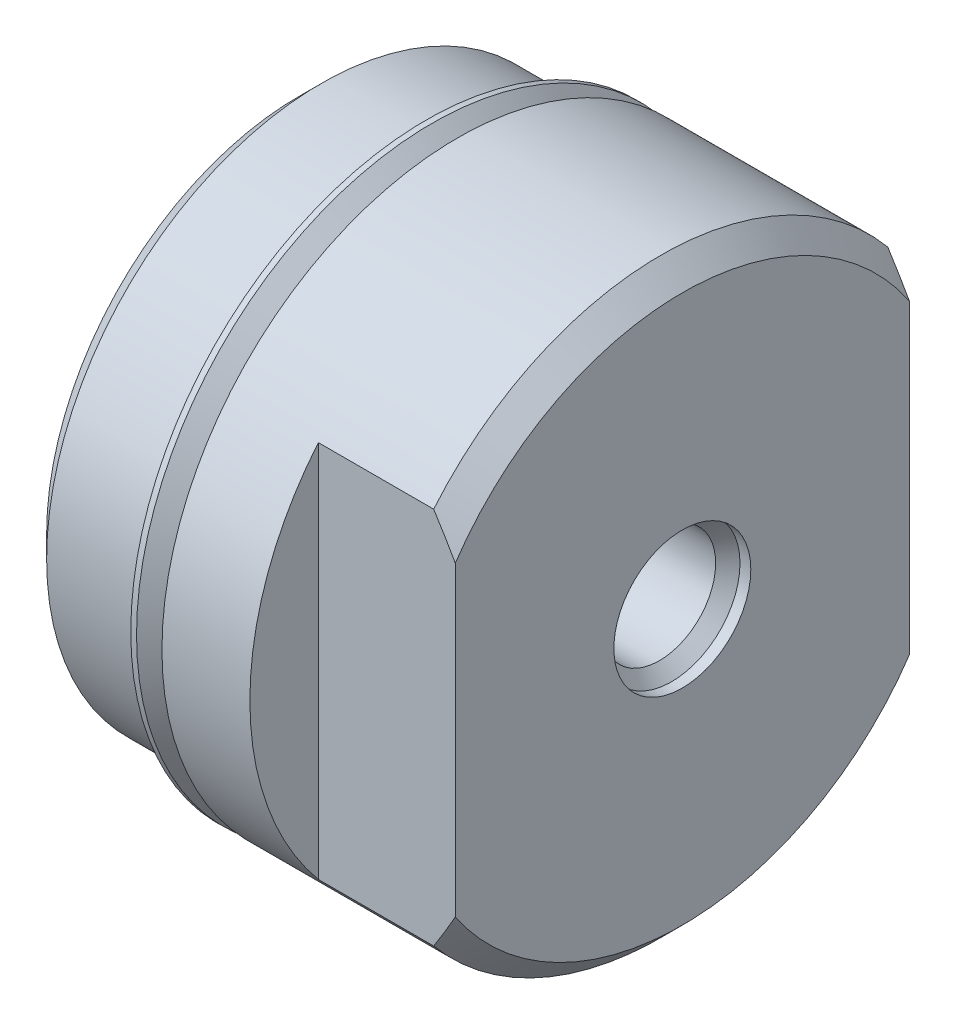
ISO-10303-21;
HEADER;
FILE_DESCRIPTION(('STEP AP214'),'2;1');
FILE_NAME('part.step','',(''),(''),'','','');
FILE_SCHEMA(('AUTOMOTIVE_DESIGN { 1 0 10303 214 1 1 1 1 }'));
ENDSEC;
DATA;
#1=APPLICATION_CONTEXT('core data for automotive mechanical design processes');
#2=APPLICATION_PROTOCOL_DEFINITION('international standard','automotive_design',2000,#1);
#3=PRODUCT_CONTEXT('',#1,'mechanical');
#4=PRODUCT('Part','Part','',(#3));
#5=PRODUCT_RELATED_PRODUCT_CATEGORY('part','',(#4));
#6=PRODUCT_DEFINITION_FORMATION('','',#4);
#7=PRODUCT_DEFINITION_CONTEXT('part definition',#1,'design');
#8=PRODUCT_DEFINITION('design','',#6,#7);
#9=PRODUCT_DEFINITION_SHAPE('','',#8);
#10=(LENGTH_UNIT() NAMED_UNIT(*) SI_UNIT(.MILLI.,.METRE.));
#11=(NAMED_UNIT(*) PLANE_ANGLE_UNIT() SI_UNIT($,.RADIAN.));
#12=(NAMED_UNIT(*) SI_UNIT($,.STERADIAN.) SOLID_ANGLE_UNIT());
#13=UNCERTAINTY_MEASURE_WITH_UNIT(LENGTH_MEASURE(1.E-05),#10,'distance_accuracy_value','');
#14=(GEOMETRIC_REPRESENTATION_CONTEXT(3) GLOBAL_UNCERTAINTY_ASSIGNED_CONTEXT((#13)) GLOBAL_UNIT_ASSIGNED_CONTEXT((#10,
#11,#12)) REPRESENTATION_CONTEXT('',''));
#15=CARTESIAN_POINT('',(0.,0.,0.));
#16=DIRECTION('',(0.,0.,1.));
#17=DIRECTION('',(1.,0.,0.));
#18=AXIS2_PLACEMENT_3D('',#15,#16,#17);
#19=CARTESIAN_POINT('',(5.5626,8.9154,0.));
#20=DIRECTION('',(1.,0.,0.));
#21=DIRECTION('',(0.,0.,-1.));
#22=AXIS2_PLACEMENT_3D('',#19,#20,#21);
#23=PLANE('',#22);
#24=CARTESIAN_POINT('',(5.5626,0.,0.));
#25=DIRECTION('',(-1.,0.,0.));
#26=DIRECTION('',(0.,0.,1.));
#27=AXIS2_PLACEMENT_3D('',#24,#25,#26);
#28=CIRCLE('',#27,8.9154);
#29=CARTESIAN_POINT('',(5.5626,0.,8.9154));
#30=VERTEX_POINT('',#29);
#31=EDGE_CURVE('E121',#30,#30,#28,.T.);
#32=ORIENTED_EDGE('',*,*,#31,.F.);
#33=EDGE_LOOP('',(#32));
#34=FACE_BOUND('',#33,.T.);
#35=CARTESIAN_POINT('',(5.5626,0.,0.));
#36=DIRECTION('',(1.,0.,0.));
#37=DIRECTION('',(0.,0.,-1.));
#38=AXIS2_PLACEMENT_3D('',#35,#36,#37);
#39=CIRCLE('',#38,9.2310307345285);
#40=CARTESIAN_POINT('',(5.5626,0.,-9.2310307345285));
#41=VERTEX_POINT('',#40);
#42=EDGE_CURVE('E11',#41,#41,#39,.T.);
#43=ORIENTED_EDGE('',*,*,#42,.F.);
#44=EDGE_LOOP('',(#43));
#45=FACE_BOUND('',#44,.T.);
#46=ADVANCED_FACE('F36',(#34,#45),#23,.F.);
#47=CARTESIAN_POINT('',(5.5626,0.,0.));
#48=DIRECTION('',(-1.,0.,0.));
#49=DIRECTION('',(0.,0.,1.));
#50=AXIS2_PLACEMENT_3D('',#47,#48,#49);
#51=CIRCLE('',#50,10.414);
#52=CARTESIAN_POINT('',(5.5626,0.,10.414));
#53=VERTEX_POINT('',#52);
#54=EDGE_CURVE('E118',#53,#53,#51,.T.);
#55=ORIENTED_EDGE('',*,*,#54,.T.);
#56=EDGE_LOOP('',(#55));
#57=FACE_BOUND('',#56,.T.);
#58=CARTESIAN_POINT('',(5.5626,0.,0.));
#59=DIRECTION('',(1.,0.,0.));
#60=DIRECTION('',(0.,0.,-1.));
#61=AXIS2_PLACEMENT_3D('',#58,#59,#60);
#62=CIRCLE('',#61,9.5183989304027);
#63=CARTESIAN_POINT('',(5.5626,0.,-9.5183989304027));
#64=VERTEX_POINT('',#63);
#65=EDGE_CURVE('E44',#64,#64,#62,.F.);
#66=ORIENTED_EDGE('',*,*,#65,.F.);
#67=EDGE_LOOP('',(#66));
#68=FACE_BOUND('',#67,.T.);
#69=ADVANCED_FACE('F202',(#57,#68),#23,.F.);
#70=CARTESIAN_POINT('',(13.4874,0.,0.));
#71=DIRECTION('',(-1.,0.,0.));
#72=DIRECTION('',(0.,0.,1.));
#73=AXIS2_PLACEMENT_3D('',#70,#71,#72);
#74=CYLINDRICAL_SURFACE('',#73,10.414);
#75=ORIENTED_EDGE('',*,*,#54,.F.);
#76=EDGE_LOOP('',(#75));
#77=FACE_BOUND('',#76,.T.);
#78=DIRECTION('',(-1.,0.,0.));
#79=VECTOR('',#78,1.);
#80=CARTESIAN_POINT('',(13.4874,6.66598792378144,8.001));
#81=LINE('',#80,#79);
#82=CARTESIAN_POINT('',(12.7254,6.66598792378144,8.001));
#83=VERTEX_POINT('',#82);
#84=CARTESIAN_POINT('',(8.6614,6.66598792378144,8.001));
#85=VERTEX_POINT('',#84);
#86=EDGE_CURVE('E156',#83,#85,#81,.T.);
#87=ORIENTED_EDGE('',*,*,#86,.F.);
#88=CARTESIAN_POINT('',(12.7254,0.,0.));
#89=DIRECTION('',(-1.,0.,0.));
#90=DIRECTION('',(0.,0.,1.));
#91=AXIS2_PLACEMENT_3D('',#88,#89,#90);
#92=CIRCLE('',#91,10.414);
#93=CARTESIAN_POINT('',(12.7254,6.66598792378144,-8.001));
#94=VERTEX_POINT('',#93);
#95=EDGE_CURVE('E115',#83,#94,#92,.T.);
#96=ORIENTED_EDGE('',*,*,#95,.T.);
#97=DIRECTION('',(-1.,0.,0.));
#98=VECTOR('',#97,1.);
#99=CARTESIAN_POINT('',(13.4874,6.66598792378144,-8.001));
#100=LINE('',#99,#98);
#101=CARTESIAN_POINT('',(8.6614,6.66598792378144,-8.001));
#102=VERTEX_POINT('',#101);
#103=EDGE_CURVE('E165',#102,#94,#100,.F.);
#104=ORIENTED_EDGE('',*,*,#103,.F.);
#105=CARTESIAN_POINT('',(8.6614,0.,0.));
#106=DIRECTION('',(1.,0.,0.));
#107=DIRECTION('',(0.,0.,-1.));
#108=AXIS2_PLACEMENT_3D('',#105,#106,#107);
#109=CIRCLE('',#108,10.414);
#110=CARTESIAN_POINT('',(8.6614,-6.66598792378144,-8.001));
#111=VERTEX_POINT('',#110);
#112=EDGE_CURVE('E136',#111,#102,#109,.T.);
#113=ORIENTED_EDGE('',*,*,#112,.F.);
#114=DIRECTION('',(-1.,0.,0.));
#115=VECTOR('',#114,1.);
#116=CARTESIAN_POINT('',(13.4874,-6.66598792378144,-8.001));
#117=LINE('',#116,#115);
#118=CARTESIAN_POINT('',(12.7254,-6.66598792378144,-8.001));
#119=VERTEX_POINT('',#118);
#120=EDGE_CURVE('E105',#119,#111,#117,.T.);
#121=ORIENTED_EDGE('',*,*,#120,.F.);
#122=CARTESIAN_POINT('',(12.7254,-6.66598792378144,8.001));
#123=VERTEX_POINT('',#122);
#124=EDGE_CURVE('E104',#119,#123,#92,.T.);
#125=ORIENTED_EDGE('',*,*,#124,.T.);
#126=DIRECTION('',(-1.,0.,0.));
#127=VECTOR('',#126,1.);
#128=CARTESIAN_POINT('',(13.4874,-6.66598792378144,8.001));
#129=LINE('',#128,#127);
#130=CARTESIAN_POINT('',(8.6614,-6.66598792378144,8.001));
#131=VERTEX_POINT('',#130);
#132=EDGE_CURVE('E110',#131,#123,#129,.F.);
#133=ORIENTED_EDGE('',*,*,#132,.F.);
#134=EDGE_CURVE('E138',#85,#131,#109,.T.);
#135=ORIENTED_EDGE('',*,*,#134,.F.);
#136=EDGE_LOOP('',(#87,#96,#104,#113,#121,#125,#133,#135));
#137=FACE_BOUND('',#136,.T.);
#138=ADVANCED_FACE('F159',(#77,#137),#74,.T.);
#139=CARTESIAN_POINT('',(13.4874,0.,0.));
#140=DIRECTION('',(-1.,0.,0.));
#141=DIRECTION('',(0.,0.,1.));
#142=AXIS2_PLACEMENT_3D('',#139,#140,#141);
#143=CONICAL_SURFACE('',#142,9.652,0.78539816339745);
#144=CARTESIAN_POINT('',(0.220039382079096,-21.4774553924413,8.001));
#145=CARTESIAN_POINT('',(0.534282164887954,-21.1421058763633,8.001));
#146=CARTESIAN_POINT('',(0.848057323411953,-20.8063171421515,8.001));
#147=CARTESIAN_POINT('',(1.47451167040226,-20.1337151034573,8.001));
#148=CARTESIAN_POINT('',(1.78719085195088,-19.7969017925328,8.001));
#149=CARTESIAN_POINT('',(2.4113726546427,-19.1220177624755,8.001));
#150=CARTESIAN_POINT('',(2.72287493600201,-18.7839467289412,8.001));
#151=CARTESIAN_POINT('',(3.34441033884047,-18.1064573416529,8.001));
#152=CARTESIAN_POINT('',(3.65444346280691,-17.7670389901817,8.001));
#153=CARTESIAN_POINT('',(4.27547036453181,-17.0836865156221,8.001));
#154=CARTESIAN_POINT('',(4.5864491495359,-16.7397387597052,8.001));
#155=CARTESIAN_POINT('',(5.2063320101731,-16.0499786348408,8.001));
#156=CARTESIAN_POINT('',(5.51523608987837,-15.7041662695555,8.001));
#157=CARTESIAN_POINT('',(6.13051080667482,-15.0103964534355,8.001));
#158=CARTESIAN_POINT('',(6.43688185791733,-14.6624393701782,8.001));
#159=CARTESIAN_POINT('',(7.04662116726838,-13.9639033872618,8.001));
#160=CARTESIAN_POINT('',(7.34998943895518,-13.6133244994709,8.001));
#161=CARTESIAN_POINT('',(7.90162641298176,-12.969059181258,8.001));
#162=CARTESIAN_POINT('',(8.15046975506583,-12.6758650982072,8.001));
#163=CARTESIAN_POINT('',(8.64511769758515,-12.0869259018483,8.001));
#164=CARTESIAN_POINT('',(8.89092232540584,-11.7911808115712,8.001));
#165=CARTESIAN_POINT('',(9.37896931805824,-11.1965320668893,8.001));
#166=CARTESIAN_POINT('',(9.62120998154455,-10.8976270139819,8.001));
#167=CARTESIAN_POINT('',(10.1011788158691,-10.2962157702136,8.001));
#168=CARTESIAN_POINT('',(10.3389070559064,-9.99370963469221,8.001));
#169=CARTESIAN_POINT('',(10.8082481579967,-9.38503041060583,8.001));
#170=CARTESIAN_POINT('',(11.0398732275207,-9.07886675925127,8.001));
#171=CARTESIAN_POINT('',(11.4961076827335,-8.46130012521109,8.001));
#172=CARTESIAN_POINT('',(11.7207165226516,-8.14989673782734,8.001));
#173=CARTESIAN_POINT('',(12.1607446994158,-7.52099284514357,8.001));
#174=CARTESIAN_POINT('',(12.3761709502147,-7.20349719784745,8.001));
#175=CARTESIAN_POINT('',(12.7952474130229,-6.56086096215835,8.001));
#176=CARTESIAN_POINT('',(12.9989001358799,-6.23572202474968,8.001));
#177=CARTESIAN_POINT('',(13.3524318721083,-5.6404173121642,8.001));
#178=CARTESIAN_POINT('',(13.5050552106932,-5.3718886049808,8.001));
#179=CARTESIAN_POINT('',(13.7974864520066,-4.8278357298241,8.001));
#180=CARTESIAN_POINT('',(13.9372926608211,-4.55231064333512,8.001));
#181=CARTESIAN_POINT('',(14.2003778621076,-3.9938332137782,8.001));
#182=CARTESIAN_POINT('',(14.3236776129658,-3.71089074486359,8.001));
#183=CARTESIAN_POINT('',(14.5495250115992,-3.13679616840137,8.001));
#184=CARTESIAN_POINT('',(14.6520789513814,-2.84564658060933,8.001));
#185=CARTESIAN_POINT('',(14.8119202711564,-2.31935527708664,8.001));
#186=CARTESIAN_POINT('',(14.8742009733559,-2.0857384557346,8.001));
#187=CARTESIAN_POINT('',(14.9803924013524,-1.61433712262023,8.001));
#188=CARTESIAN_POINT('',(15.0243056934657,-1.37655319793094,8.001));
#189=CARTESIAN_POINT('',(15.0915473951066,-0.898715905997193,8.001));
#190=CARTESIAN_POINT('',(15.1149319429455,-0.65867055370178,8.001));
#191=CARTESIAN_POINT('',(15.1400395678491,-0.177436767788084,8.001));
#192=CARTESIAN_POINT('',(15.1417632193926,0.0637516353450899,8.001));
#193=CARTESIAN_POINT('',(15.1234465434277,0.545402130906983,8.001));
#194=CARTESIAN_POINT('',(15.1033958278858,0.785863821734663,8.001));
#195=CARTESIAN_POINT('',(15.0426264248445,1.26413955636313,8.001));
#196=CARTESIAN_POINT('',(15.0019060333082,1.50195338021788,8.001));
#197=CARTESIAN_POINT('',(14.9016638551353,1.97427416457578,8.001));
#198=CARTESIAN_POINT('',(14.8420862181323,2.20876911192676,8.001));
#199=CARTESIAN_POINT('',(14.7066460344345,2.67294809050448,8.001));
#200=CARTESIAN_POINT('',(14.6307833722534,2.90263208760137,8.001));
#201=CARTESIAN_POINT('',(14.4480675453347,3.40420517803057,8.001));
#202=CARTESIAN_POINT('',(14.3380504932986,3.67493447834809,8.001));
#203=CARTESIAN_POINT('',(14.1018751345885,4.20931785816478,8.001));
#204=CARTESIAN_POINT('',(13.9757091681385,4.4729685078477,8.001));
#205=CARTESIAN_POINT('',(13.7103283426325,4.99417536649758,8.001));
#206=CARTESIAN_POINT('',(13.5710900573404,5.25171955692558,8.001));
#207=CARTESIAN_POINT('',(13.282404043387,5.7609324982155,8.001));
#208=CARTESIAN_POINT('',(13.1329578159455,6.01260210574349,8.001));
#209=CARTESIAN_POINT('',(12.8239014188262,6.51406060097793,8.001));
#210=CARTESIAN_POINT('',(12.6641855082871,6.7637840140781,8.001));
#211=CARTESIAN_POINT('',(12.3379712964711,7.25875290543963,8.001));
#212=CARTESIAN_POINT('',(12.1714728132821,7.50399826334137,8.001));
#213=CARTESIAN_POINT('',(11.8331366811772,7.9903735771596,8.001));
#214=CARTESIAN_POINT('',(11.6613049958782,8.23150769361531,8.001));
#215=CARTESIAN_POINT('',(11.3131071746725,8.71046645660889,8.001));
#216=CARTESIAN_POINT('',(11.1367410989079,8.94829114697697,8.001));
#217=CARTESIAN_POINT('',(10.7474351154817,9.46459804969345,8.001));
#218=CARTESIAN_POINT('',(10.5337374572021,9.74250815553285,8.001));
#219=CARTESIAN_POINT('',(10.1020399400804,10.2949718308266,8.001));
#220=CARTESIAN_POINT('',(9.88403995184555,10.5695252989265,8.001));
#221=CARTESIAN_POINT('',(9.44447723315052,11.1158093724549,8.001));
#222=CARTESIAN_POINT('',(9.22291412689902,11.3875396750916,8.001));
#223=CARTESIAN_POINT('',(8.77683343493568,11.9285664063186,8.001));
#224=CARTESIAN_POINT('',(8.55231581112815,12.1978628034504,8.001));
#225=CARTESIAN_POINT('',(7.87464162974955,13.0031273500236,8.001));
#226=CARTESIAN_POINT('',(7.41777025710678,13.5359693546306,8.001));
#227=CARTESIAN_POINT('',(6.49686254119638,14.5954244016214,8.001));
#228=CARTESIAN_POINT('',(6.0328260190057,15.1220372878742,8.001));
#229=CARTESIAN_POINT('',(5.34668659782763,15.8926760238447,8.001));
#230=CARTESIAN_POINT('',(5.12668213941226,16.1385745682875,8.001));
#231=CARTESIAN_POINT('',(4.68562038973378,16.6294194776046,8.001));
#232=CARTESIAN_POINT('',(4.4645631132511,16.8743658557591,8.001));
#233=CARTESIAN_POINT('',(3.79998353099521,17.6079518218142,8.001));
#234=CARTESIAN_POINT('',(3.35506427077638,18.0953261377046,8.001));
#235=CARTESIAN_POINT('',(2.46313832357026,19.0664275659711,8.001));
#236=CARTESIAN_POINT('',(2.01613730807958,19.5501598952816,8.001));
#237=CARTESIAN_POINT('',(1.11974921742223,20.5153736608367,8.001));
#238=CARTESIAN_POINT('',(0.670362237935285,20.9968551859063,8.001));
#239=CARTESIAN_POINT('',(0.220039382079098,21.4774553924413,8.001));
#240=B_SPLINE_CURVE_WITH_KNOTS('',3,(#144,#145,#146,#147,#148,#149,#150,#151,#152,#153,#154,
#155,#156,#157,#158,#159,#160,#161,#162,#163,#164,#165,#166,#167,#168,#169,#170,#171,#172,#173,
#174,#175,#176,#177,#178,#179,#180,#181,#182,#183,#184,#185,#186,#187,#188,#189,#190,#191,#192,
#193,#194,#195,#196,#197,#198,#199,#200,#201,#202,#203,#204,#205,#206,#207,#208,#209,#210,#211,
#212,#213,#214,#215,#216,#217,#218,#219,#220,#221,#222,#223,#224,#225,#226,#227,#228,#229,#230,
#231,#232,#233,#234,#235,#236,#237,#238,#239),.UNSPECIFIED.,.F.,.F.,(4,2,2,2,2,2,2,2,2,2,2,2,2,
2,2,2,2,2,2,2,2,2,2,2,2,2,2,2,2,2,2,2,2,2,2,2,2,2,2,2,2,2,2,2,2,2,2,4),(0.,1.3787212394126,
2.75745116554139,4.1365526500433,5.51565179889183,6.9067129751764,8.29777142033306,
9.68859774107669,11.07941776977,12.2330786692774,13.3867291641915,14.5409135937351,
15.6950803092423,16.846729639834,17.998468331685,19.1493239343836,20.2999331908411,
21.2262789815489,22.1527470223039,23.0780387743353,24.003049472043,24.7277456891039,
25.4523406168997,26.1749478246554,26.8975358677637,27.6204687919719,28.3434613254646,
29.0686155380469,29.7937748932787,30.6697864863382,31.546215141001,32.42424552114,
33.3021470515795,34.191303413866,35.0804836395165,35.9687030646441,36.8569107149282,
37.9085731682088,38.9602672986015,40.012073085056,41.0638924468589,43.169467495345,
45.2750952080716,46.2649474951647,47.2547859265096,49.2345114490144,51.2104236580387,
53.1862572204657),.UNSPECIFIED.);
#241=CARTESIAN_POINT('',(13.4874,-5.3986204719354,8.001));
#242=VERTEX_POINT('',#241);
#243=EDGE_CURVE('E51',#123,#242,#240,.T.);
#244=ORIENTED_EDGE('',*,*,#243,.F.);
#245=ORIENTED_EDGE('',*,*,#124,.F.);
#246=CARTESIAN_POINT('',(0.220039382079096,21.4774553924413,-8.001));
#247=CARTESIAN_POINT('',(0.534282164887954,21.1421058763633,-8.001));
#248=CARTESIAN_POINT('',(0.848057323411953,20.8063171421515,-8.001));
#249=CARTESIAN_POINT('',(1.47451167040226,20.1337151034573,-8.001));
#250=CARTESIAN_POINT('',(1.78719085195088,19.7969017925328,-8.001));
#251=CARTESIAN_POINT('',(2.4113726546427,19.1220177624755,-8.001));
#252=CARTESIAN_POINT('',(2.72287493600201,18.7839467289412,-8.001));
#253=CARTESIAN_POINT('',(3.34441033884047,18.1064573416529,-8.001));
#254=CARTESIAN_POINT('',(3.65444346280691,17.7670389901817,-8.001));
#255=CARTESIAN_POINT('',(4.27547036453181,17.0836865156221,-8.001));
#256=CARTESIAN_POINT('',(4.5864491495359,16.7397387597052,-8.001));
#257=CARTESIAN_POINT('',(5.2063320101731,16.0499786348408,-8.001));
#258=CARTESIAN_POINT('',(5.51523608987837,15.7041662695555,-8.001));
#259=CARTESIAN_POINT('',(6.13051080667482,15.0103964534355,-8.001));
#260=CARTESIAN_POINT('',(6.43688185791733,14.6624393701782,-8.001));
#261=CARTESIAN_POINT('',(7.04662116726838,13.9639033872618,-8.001));
#262=CARTESIAN_POINT('',(7.34998943895518,13.6133244994709,-8.001));
#263=CARTESIAN_POINT('',(7.90162641298176,12.969059181258,-8.001));
#264=CARTESIAN_POINT('',(8.15046975506583,12.6758650982072,-8.001));
#265=CARTESIAN_POINT('',(8.64511769758515,12.0869259018483,-8.001));
#266=CARTESIAN_POINT('',(8.89092232540584,11.7911808115712,-8.001));
#267=CARTESIAN_POINT('',(9.37896931805824,11.1965320668893,-8.001));
#268=CARTESIAN_POINT('',(9.62120998154455,10.8976270139819,-8.001));
#269=CARTESIAN_POINT('',(10.1011788158691,10.2962157702136,-8.001));
#270=CARTESIAN_POINT('',(10.3389070559064,9.99370963469221,-8.001));
#271=CARTESIAN_POINT('',(10.8082481579967,9.38503041060583,-8.001));
#272=CARTESIAN_POINT('',(11.0398732275207,9.07886675925127,-8.001));
#273=CARTESIAN_POINT('',(11.4961076827335,8.46130012521109,-8.001));
#274=CARTESIAN_POINT('',(11.7207165226516,8.14989673782734,-8.001));
#275=CARTESIAN_POINT('',(12.1607446994158,7.52099284514357,-8.001));
#276=CARTESIAN_POINT('',(12.3761709502147,7.20349719784745,-8.001));
#277=CARTESIAN_POINT('',(12.7952474130229,6.56086096215835,-8.001));
#278=CARTESIAN_POINT('',(12.9989001358799,6.23572202474968,-8.001));
#279=CARTESIAN_POINT('',(13.3524318721083,5.6404173121642,-8.001));
#280=CARTESIAN_POINT('',(13.5050552106932,5.3718886049808,-8.001));
#281=CARTESIAN_POINT('',(13.7974864520066,4.8278357298241,-8.001));
#282=CARTESIAN_POINT('',(13.9372926608211,4.55231064333512,-8.001));
#283=CARTESIAN_POINT('',(14.2003778621076,3.9938332137782,-8.001));
#284=CARTESIAN_POINT('',(14.3236776129658,3.71089074486359,-8.001));
#285=CARTESIAN_POINT('',(14.5495250115992,3.13679616840137,-8.001));
#286=CARTESIAN_POINT('',(14.6520789513814,2.84564658060933,-8.001));
#287=CARTESIAN_POINT('',(14.8119202711564,2.31935527708664,-8.001));
#288=CARTESIAN_POINT('',(14.8742009733559,2.0857384557346,-8.001));
#289=CARTESIAN_POINT('',(14.9803924013524,1.61433712262023,-8.001));
#290=CARTESIAN_POINT('',(15.0243056934657,1.37655319793094,-8.001));
#291=CARTESIAN_POINT('',(15.0915473951066,0.898715905997193,-8.001));
#292=CARTESIAN_POINT('',(15.1149319429455,0.65867055370178,-8.001));
#293=CARTESIAN_POINT('',(15.1400395678491,0.177436767788084,-8.001));
#294=CARTESIAN_POINT('',(15.1417632193926,-0.0637516353450899,-8.001));
#295=CARTESIAN_POINT('',(15.1234465434277,-0.545402130906983,-8.001));
#296=CARTESIAN_POINT('',(15.1033958278858,-0.785863821734663,-8.001));
#297=CARTESIAN_POINT('',(15.0426264248445,-1.26413955636313,-8.001));
#298=CARTESIAN_POINT('',(15.0019060333082,-1.50195338021788,-8.001));
#299=CARTESIAN_POINT('',(14.9016638551353,-1.97427416457578,-8.001));
#300=CARTESIAN_POINT('',(14.8420862181323,-2.20876911192676,-8.001));
#301=CARTESIAN_POINT('',(14.7066460344345,-2.67294809050448,-8.001));
#302=CARTESIAN_POINT('',(14.6307833722534,-2.90263208760137,-8.001));
#303=CARTESIAN_POINT('',(14.4480675453347,-3.40420517803057,-8.001));
#304=CARTESIAN_POINT('',(14.3380504932986,-3.67493447834809,-8.001));
#305=CARTESIAN_POINT('',(14.1018751345885,-4.20931785816478,-8.001));
#306=CARTESIAN_POINT('',(13.9757091681385,-4.4729685078477,-8.001));
#307=CARTESIAN_POINT('',(13.7103283426325,-4.99417536649758,-8.001));
#308=CARTESIAN_POINT('',(13.5710900573404,-5.25171955692558,-8.001));
#309=CARTESIAN_POINT('',(13.282404043387,-5.7609324982155,-8.001));
#310=CARTESIAN_POINT('',(13.1329578159455,-6.01260210574349,-8.001));
#311=CARTESIAN_POINT('',(12.8239014188262,-6.51406060097793,-8.001));
#312=CARTESIAN_POINT('',(12.6641855082871,-6.7637840140781,-8.001));
#313=CARTESIAN_POINT('',(12.3379712964711,-7.25875290543963,-8.001));
#314=CARTESIAN_POINT('',(12.1714728132821,-7.50399826334137,-8.001));
#315=CARTESIAN_POINT('',(11.8331366811772,-7.9903735771596,-8.001));
#316=CARTESIAN_POINT('',(11.6613049958782,-8.23150769361531,-8.001));
#317=CARTESIAN_POINT('',(11.3131071746725,-8.71046645660889,-8.001));
#318=CARTESIAN_POINT('',(11.1367410989079,-8.94829114697697,-8.001));
#319=CARTESIAN_POINT('',(10.7474351154817,-9.46459804969345,-8.001));
#320=CARTESIAN_POINT('',(10.5337374572021,-9.74250815553285,-8.001));
#321=CARTESIAN_POINT('',(10.1020399400804,-10.2949718308266,-8.001));
#322=CARTESIAN_POINT('',(9.88403995184555,-10.5695252989265,-8.001));
#323=CARTESIAN_POINT('',(9.44447723315052,-11.1158093724549,-8.001));
#324=CARTESIAN_POINT('',(9.22291412689902,-11.3875396750916,-8.001));
#325=CARTESIAN_POINT('',(8.77683343493568,-11.9285664063186,-8.001));
#326=CARTESIAN_POINT('',(8.55231581112815,-12.1978628034504,-8.001));
#327=CARTESIAN_POINT('',(7.87464162974955,-13.0031273500236,-8.001));
#328=CARTESIAN_POINT('',(7.41777025710678,-13.5359693546306,-8.001));
#329=CARTESIAN_POINT('',(6.49686254119638,-14.5954244016214,-8.001));
#330=CARTESIAN_POINT('',(6.0328260190057,-15.1220372878742,-8.001));
#331=CARTESIAN_POINT('',(5.34668659782763,-15.8926760238447,-8.001));
#332=CARTESIAN_POINT('',(5.12668213941226,-16.1385745682875,-8.001));
#333=CARTESIAN_POINT('',(4.68562038973378,-16.6294194776046,-8.001));
#334=CARTESIAN_POINT('',(4.4645631132511,-16.8743658557591,-8.001));
#335=CARTESIAN_POINT('',(3.79998353099521,-17.6079518218142,-8.001));
#336=CARTESIAN_POINT('',(3.35506427077638,-18.0953261377046,-8.001));
#337=CARTESIAN_POINT('',(2.46313832357026,-19.0664275659711,-8.001));
#338=CARTESIAN_POINT('',(2.01613730807958,-19.5501598952816,-8.001));
#339=CARTESIAN_POINT('',(1.11974921742223,-20.5153736608367,-8.001));
#340=CARTESIAN_POINT('',(0.670362237935285,-20.9968551859063,-8.001));
#341=CARTESIAN_POINT('',(0.220039382079098,-21.4774553924413,-8.001));
#342=B_SPLINE_CURVE_WITH_KNOTS('',3,(#246,#247,#248,#249,#250,#251,#252,#253,#254,#255,#256,
#257,#258,#259,#260,#261,#262,#263,#264,#265,#266,#267,#268,#269,#270,#271,#272,#273,#274,#275,
#276,#277,#278,#279,#280,#281,#282,#283,#284,#285,#286,#287,#288,#289,#290,#291,#292,#293,#294,
#295,#296,#297,#298,#299,#300,#301,#302,#303,#304,#305,#306,#307,#308,#309,#310,#311,#312,#313,
#314,#315,#316,#317,#318,#319,#320,#321,#322,#323,#324,#325,#326,#327,#328,#329,#330,#331,#332,
#333,#334,#335,#336,#337,#338,#339,#340,#341),.UNSPECIFIED.,.F.,.F.,(4,2,2,2,2,2,2,2,2,2,2,2,2,
2,2,2,2,2,2,2,2,2,2,2,2,2,2,2,2,2,2,2,2,2,2,2,2,2,2,2,2,2,2,2,2,2,2,4),(0.,1.3787212394126,
2.75745116554139,4.1365526500433,5.51565179889183,6.9067129751764,8.29777142033306,
9.68859774107669,11.07941776977,12.2330786692774,13.3867291641915,14.5409135937351,
15.6950803092423,16.846729639834,17.998468331685,19.1493239343836,20.2999331908411,
21.2262789815489,22.1527470223039,23.0780387743353,24.003049472043,24.7277456891039,
25.4523406168997,26.1749478246554,26.8975358677637,27.6204687919719,28.3434613254646,
29.0686155380469,29.7937748932787,30.6697864863382,31.546215141001,32.42424552114,
33.3021470515795,34.191303413866,35.0804836395165,35.9687030646441,36.8569107149282,
37.9085731682088,38.9602672986015,40.012073085056,41.0638924468589,43.169467495345,
45.2750952080716,46.2649474951647,47.2547859265096,49.2345114490144,51.2104236580387,
53.1862572204657),.UNSPECIFIED.);
#343=CARTESIAN_POINT('',(13.4874,-5.3986204719354,-8.001));
#344=VERTEX_POINT('',#343);
#345=EDGE_CURVE('E89',#344,#119,#342,.T.);
#346=ORIENTED_EDGE('',*,*,#345,.F.);
#347=CARTESIAN_POINT('',(13.4874,0.,0.));
#348=DIRECTION('',(-1.,0.,0.));
#349=DIRECTION('',(0.,0.,1.));
#350=AXIS2_PLACEMENT_3D('',#347,#348,#349);
#351=CIRCLE('',#350,9.652);
#352=EDGE_CURVE('E102',#344,#242,#351,.T.);
#353=ORIENTED_EDGE('',*,*,#352,.T.);
#354=EDGE_LOOP('',(#244,#245,#346,#353));
#355=FACE_BOUND('',#354,.T.);
#356=ADVANCED_FACE('F101',(#355),#143,.T.);
#357=CARTESIAN_POINT('',(13.4874,5.3986204719354,8.001));
#358=VERTEX_POINT('',#357);
#359=EDGE_CURVE('E174',#358,#83,#240,.T.);
#360=ORIENTED_EDGE('',*,*,#359,.F.);
#361=CARTESIAN_POINT('',(13.4874,5.3986204719354,-8.001));
#362=VERTEX_POINT('',#361);
#363=EDGE_CURVE('E109',#358,#362,#351,.T.);
#364=ORIENTED_EDGE('',*,*,#363,.T.);
#365=EDGE_CURVE('E59',#94,#362,#342,.T.);
#366=ORIENTED_EDGE('',*,*,#365,.F.);
#367=ORIENTED_EDGE('',*,*,#95,.F.);
#368=EDGE_LOOP('',(#360,#364,#366,#367));
#369=FACE_BOUND('',#368,.T.);
#370=ADVANCED_FACE('F191',(#369),#143,.T.);
#371=CARTESIAN_POINT('',(13.4874,9.652,0.));
#372=DIRECTION('',(-1.,0.,0.));
#373=DIRECTION('',(0.,0.,1.));
#374=AXIS2_PLACEMENT_3D('',#371,#372,#373);
#375=PLANE('',#374);
#376=CARTESIAN_POINT('',(13.4874,0.,0.));
#377=DIRECTION('',(1.,0.,0.));
#378=DIRECTION('',(0.,0.,-1.));
#379=AXIS2_PLACEMENT_3D('',#376,#377,#378);
#380=CIRCLE('',#379,2.413);
#381=CARTESIAN_POINT('',(13.4874,0.,-2.413));
#382=VERTEX_POINT('',#381);
#383=EDGE_CURVE('E488',#382,#382,#380,.T.);
#384=ORIENTED_EDGE('',*,*,#383,.F.);
#385=EDGE_LOOP('',(#384));
#386=FACE_BOUND('',#385,.T.);
#387=DIRECTION('',(0.,1.,0.));
#388=VECTOR('',#387,1.);
#389=CARTESIAN_POINT('',(13.4874,9.652,8.001));
#390=LINE('',#389,#388);
#391=EDGE_CURVE('E95',#242,#358,#390,.T.);
#392=ORIENTED_EDGE('',*,*,#391,.F.);
#393=ORIENTED_EDGE('',*,*,#352,.F.);
#394=DIRECTION('',(0.,-1.,0.));
#395=VECTOR('',#394,1.);
#396=CARTESIAN_POINT('',(13.4874,9.652,-8.001));
#397=LINE('',#396,#395);
#398=EDGE_CURVE('E86',#362,#344,#397,.T.);
#399=ORIENTED_EDGE('',*,*,#398,.F.);
#400=ORIENTED_EDGE('',*,*,#363,.F.);
#401=EDGE_LOOP('',(#392,#393,#399,#400));
#402=FACE_BOUND('',#401,.T.);
#403=ADVANCED_FACE('F108',(#386,#402),#375,.F.);
#404=CARTESIAN_POINT('',(0.,0.,0.));
#405=DIRECTION('',(1.,0.,0.));
#406=DIRECTION('',(0.,0.,-1.));
#407=AXIS2_PLACEMENT_3D('',#404,#405,#406);
#408=PLANE('',#407);
#409=CARTESIAN_POINT('',(0.,0.,0.));
#410=DIRECTION('',(-1.,0.,0.));
#411=DIRECTION('',(0.,0.,1.));
#412=AXIS2_PLACEMENT_3D('',#409,#410,#411);
#413=CIRCLE('',#412,6.604);
#414=CARTESIAN_POINT('',(0.,0.,6.604));
#415=VERTEX_POINT('',#414);
#416=EDGE_CURVE('E141',#415,#415,#413,.T.);
#417=ORIENTED_EDGE('',*,*,#416,.F.);
#418=EDGE_LOOP('',(#417));
#419=FACE_BOUND('',#418,.T.);
#420=CARTESIAN_POINT('',(0.,0.,0.));
#421=DIRECTION('',(-1.,0.,0.));
#422=DIRECTION('',(0.,0.,1.));
#423=AXIS2_PLACEMENT_3D('',#420,#421,#422);
#424=CIRCLE('',#423,8.9154);
#425=CARTESIAN_POINT('',(0.,0.,8.9154));
#426=VERTEX_POINT('',#425);
#427=EDGE_CURVE('E96',#426,#426,#424,.T.);
#428=ORIENTED_EDGE('',*,*,#427,.T.);
#429=EDGE_LOOP('',(#428));
#430=FACE_BOUND('',#429,.T.);
#431=ADVANCED_FACE('F38',(#419,#430),#408,.F.);
#432=CARTESIAN_POINT('',(0.762000000000001,0.,0.));
#433=DIRECTION('',(1.,0.,0.));
#434=DIRECTION('',(0.,0.,-1.));
#435=AXIS2_PLACEMENT_3D('',#432,#433,#434);
#436=CONICAL_SURFACE('',#435,9.6774,0.785398163397448);
#437=ORIENTED_EDGE('',*,*,#427,.F.);
#438=EDGE_LOOP('',(#437));
#439=FACE_BOUND('',#438,.T.);
#440=CARTESIAN_POINT('',(0.762000000000001,0.,0.));
#441=DIRECTION('',(-1.,0.,0.));
#442=DIRECTION('',(0.,0.,1.));
#443=AXIS2_PLACEMENT_3D('',#440,#441,#442);
#444=CIRCLE('',#443,9.6774);
#445=CARTESIAN_POINT('',(0.762000000000001,0.,9.6774));
#446=VERTEX_POINT('',#445);
#447=EDGE_CURVE('E130',#446,#446,#444,.T.);
#448=ORIENTED_EDGE('',*,*,#447,.T.);
#449=EDGE_LOOP('',(#448));
#450=FACE_BOUND('',#449,.T.);
#451=ADVANCED_FACE('F197',(#439,#450),#436,.T.);
#452=CARTESIAN_POINT('',(13.4874,0.,0.));
#453=DIRECTION('',(-1.,0.,0.));
#454=DIRECTION('',(0.,0.,1.));
#455=AXIS2_PLACEMENT_3D('',#452,#453,#454);
#456=CYLINDRICAL_SURFACE('',#455,9.6774);
#457=ORIENTED_EDGE('',*,*,#447,.F.);
#458=EDGE_LOOP('',(#457));
#459=FACE_BOUND('',#458,.T.);
#460=CARTESIAN_POINT('',(4.0386,0.,0.));
#461=DIRECTION('',(-1.,0.,0.));
#462=DIRECTION('',(0.,0.,1.));
#463=AXIS2_PLACEMENT_3D('',#460,#461,#462);
#464=CIRCLE('',#463,9.6774);
#465=CARTESIAN_POINT('',(4.0386,0.,9.6774));
#466=VERTEX_POINT('',#465);
#467=EDGE_CURVE('E127',#466,#466,#464,.T.);
#468=ORIENTED_EDGE('',*,*,#467,.T.);
#469=EDGE_LOOP('',(#468));
#470=FACE_BOUND('',#469,.T.);
#471=ADVANCED_FACE('F219',(#459,#470),#456,.T.);
#472=CARTESIAN_POINT('',(4.8006,0.,0.));
#473=DIRECTION('',(-1.,0.,0.));
#474=DIRECTION('',(0.,0.,1.));
#475=AXIS2_PLACEMENT_3D('',#472,#473,#474);
#476=CONICAL_SURFACE('',#475,8.9154,0.785398163397448);
#477=ORIENTED_EDGE('',*,*,#467,.F.);
#478=EDGE_LOOP('',(#477));
#479=FACE_BOUND('',#478,.T.);
#480=CARTESIAN_POINT('',(4.8006,0.,0.));
#481=DIRECTION('',(-1.,0.,0.));
#482=DIRECTION('',(0.,0.,1.));
#483=AXIS2_PLACEMENT_3D('',#480,#481,#482);
#484=CIRCLE('',#483,8.9154);
#485=CARTESIAN_POINT('',(4.8006,0.,8.9154));
#486=VERTEX_POINT('',#485);
#487=EDGE_CURVE('E124',#486,#486,#484,.T.);
#488=ORIENTED_EDGE('',*,*,#487,.T.);
#489=EDGE_LOOP('',(#488));
#490=FACE_BOUND('',#489,.T.);
#491=ADVANCED_FACE('F215',(#479,#490),#476,.T.);
#492=CARTESIAN_POINT('',(13.4874,0.,0.));
#493=DIRECTION('',(-1.,0.,0.));
#494=DIRECTION('',(0.,0.,1.));
#495=AXIS2_PLACEMENT_3D('',#492,#493,#494);
#496=CYLINDRICAL_SURFACE('',#495,8.9154);
#497=ORIENTED_EDGE('',*,*,#487,.F.);
#498=EDGE_LOOP('',(#497));
#499=FACE_BOUND('',#498,.T.);
#500=ORIENTED_EDGE('',*,*,#31,.T.);
#501=EDGE_LOOP('',(#500));
#502=FACE_BOUND('',#501,.T.);
#503=ADVANCED_FACE('F212',(#499,#502),#496,.T.);
#504=CARTESIAN_POINT('',(8.6614,-20.828,-8.001));
#505=DIRECTION('',(0.,0.,-1.));
#506=DIRECTION('',(-1.,0.,0.));
#507=AXIS2_PLACEMENT_3D('',#504,#505,#506);
#508=PLANE('',#507);
#509=ORIENTED_EDGE('',*,*,#103,.T.);
#510=ORIENTED_EDGE('',*,*,#365,.T.);
#511=ORIENTED_EDGE('',*,*,#398,.T.);
#512=ORIENTED_EDGE('',*,*,#345,.T.);
#513=ORIENTED_EDGE('',*,*,#120,.T.);
#514=DIRECTION('',(0.,1.,0.));
#515=VECTOR('',#514,1.);
#516=CARTESIAN_POINT('',(8.6614,-20.828,-8.001));
#517=LINE('',#516,#515);
#518=EDGE_CURVE('E106',#111,#102,#517,.T.);
#519=ORIENTED_EDGE('',*,*,#518,.T.);
#520=EDGE_LOOP('',(#509,#510,#511,#512,#513,#519));
#521=FACE_BOUND('',#520,.T.);
#522=ADVANCED_FACE('F88',(#521),#508,.T.);
#523=CARTESIAN_POINT('',(8.6614,0.,0.));
#524=DIRECTION('',(1.,0.,0.));
#525=DIRECTION('',(0.,0.,-1.));
#526=AXIS2_PLACEMENT_3D('',#523,#524,#525);
#527=PLANE('',#526);
#528=ORIENTED_EDGE('',*,*,#112,.T.);
#529=ORIENTED_EDGE('',*,*,#518,.F.);
#530=EDGE_LOOP('',(#528,#529));
#531=FACE_BOUND('',#530,.T.);
#532=ADVANCED_FACE('F189',(#531),#527,.T.);
#533=ORIENTED_EDGE('',*,*,#134,.T.);
#534=DIRECTION('',(0.,-1.,0.));
#535=VECTOR('',#534,1.);
#536=CARTESIAN_POINT('',(8.6614,20.828,8.001));
#537=LINE('',#536,#535);
#538=EDGE_CURVE('E151',#85,#131,#537,.T.);
#539=ORIENTED_EDGE('',*,*,#538,.F.);
#540=EDGE_LOOP('',(#533,#539));
#541=FACE_BOUND('',#540,.T.);
#542=ADVANCED_FACE('F150',(#541),#527,.T.);
#543=CARTESIAN_POINT('',(8.6614,20.828,8.001));
#544=DIRECTION('',(0.,0.,1.));
#545=DIRECTION('',(1.,0.,0.));
#546=AXIS2_PLACEMENT_3D('',#543,#544,#545);
#547=PLANE('',#546);
#548=ORIENTED_EDGE('',*,*,#132,.T.);
#549=ORIENTED_EDGE('',*,*,#243,.T.);
#550=ORIENTED_EDGE('',*,*,#391,.T.);
#551=ORIENTED_EDGE('',*,*,#359,.T.);
#552=ORIENTED_EDGE('',*,*,#86,.T.);
#553=ORIENTED_EDGE('',*,*,#538,.T.);
#554=EDGE_LOOP('',(#548,#549,#550,#551,#552,#553));
#555=FACE_BOUND('',#554,.T.);
#556=ADVANCED_FACE('F155',(#555),#547,.T.);
#557=CARTESIAN_POINT('',(6.34999999999999,0.,0.));
#558=DIRECTION('',(1.,0.,0.));
#559=DIRECTION('',(0.,0.,-1.));
#560=AXIS2_PLACEMENT_3D('',#557,#558,#559);
#561=PLANE('',#560);
#562=CARTESIAN_POINT('',(6.34999999999999,0.,0.));
#563=DIRECTION('',(1.,0.,0.));
#564=DIRECTION('',(0.,0.,-1.));
#565=AXIS2_PLACEMENT_3D('',#562,#563,#564);
#566=CIRCLE('',#565,1.98374);
#567=CARTESIAN_POINT('',(6.34999999999999,0.,-1.98374));
#568=VERTEX_POINT('',#567);
#569=EDGE_CURVE('E139',#568,#568,#566,.T.);
#570=ORIENTED_EDGE('',*,*,#569,.T.);
#571=EDGE_LOOP('',(#570));
#572=FACE_BOUND('',#571,.T.);
#573=CARTESIAN_POINT('',(6.34999999999999,0.,0.));
#574=DIRECTION('',(-1.,0.,0.));
#575=DIRECTION('',(0.,0.,1.));
#576=AXIS2_PLACEMENT_3D('',#573,#574,#575);
#577=CIRCLE('',#576,6.35);
#578=CARTESIAN_POINT('',(6.34999999999999,0.,6.35));
#579=VERTEX_POINT('',#578);
#580=EDGE_CURVE('E157',#579,#579,#577,.T.);
#581=ORIENTED_EDGE('',*,*,#580,.T.);
#582=EDGE_LOOP('',(#581));
#583=FACE_BOUND('',#582,.T.);
#584=ADVANCED_FACE('F185',(#572,#583),#561,.F.);
#585=CARTESIAN_POINT('',(0.,0.,0.));
#586=DIRECTION('',(-1.,0.,0.));
#587=DIRECTION('',(0.,0.,1.));
#588=AXIS2_PLACEMENT_3D('',#585,#586,#587);
#589=CYLINDRICAL_SURFACE('',#588,6.35);
#590=ORIENTED_EDGE('',*,*,#580,.F.);
#591=EDGE_LOOP('',(#590));
#592=FACE_BOUND('',#591,.T.);
#593=CARTESIAN_POINT('',(0.253999999999997,0.,0.));
#594=DIRECTION('',(-1.,0.,0.));
#595=DIRECTION('',(0.,0.,1.));
#596=AXIS2_PLACEMENT_3D('',#593,#594,#595);
#597=CIRCLE('',#596,6.35);
#598=CARTESIAN_POINT('',(0.253999999999997,0.,6.35));
#599=VERTEX_POINT('',#598);
#600=EDGE_CURVE('E501',#599,#599,#597,.T.);
#601=ORIENTED_EDGE('',*,*,#600,.T.);
#602=EDGE_LOOP('',(#601));
#603=FACE_BOUND('',#602,.T.);
#604=ADVANCED_FACE('F279',(#592,#603),#589,.F.);
#605=CARTESIAN_POINT('',(0.,0.,0.));
#606=DIRECTION('',(-1.,0.,0.));
#607=DIRECTION('',(0.,0.,1.));
#608=AXIS2_PLACEMENT_3D('',#605,#606,#607);
#609=CONICAL_SURFACE('',#608,6.604,0.785398163397447);
#610=ORIENTED_EDGE('',*,*,#600,.F.);
#611=EDGE_LOOP('',(#610));
#612=FACE_BOUND('',#611,.T.);
#613=ORIENTED_EDGE('',*,*,#416,.T.);
#614=EDGE_LOOP('',(#613));
#615=FACE_BOUND('',#614,.T.);
#616=ADVANCED_FACE('F286',(#612,#615),#609,.F.);
#617=CARTESIAN_POINT('',(13.4874,0.,0.));
#618=DIRECTION('',(1.,0.,0.));
#619=DIRECTION('',(0.,0.,-1.));
#620=AXIS2_PLACEMENT_3D('',#617,#618,#619);
#621=CYLINDRICAL_SURFACE('',#620,1.98374);
#622=CARTESIAN_POINT('',(12.67714,0.,0.));
#623=DIRECTION('',(1.,0.,0.));
#624=DIRECTION('',(0.,0.,-1.));
#625=AXIS2_PLACEMENT_3D('',#622,#623,#624);
#626=CIRCLE('',#625,1.98374);
#627=CARTESIAN_POINT('',(12.67714,0.,-1.98374));
#628=VERTEX_POINT('',#627);
#629=EDGE_CURVE('E142',#628,#628,#626,.T.);
#630=ORIENTED_EDGE('',*,*,#629,.T.);
#631=EDGE_LOOP('',(#630));
#632=FACE_BOUND('',#631,.T.);
#633=ORIENTED_EDGE('',*,*,#569,.F.);
#634=EDGE_LOOP('',(#633));
#635=FACE_BOUND('',#634,.T.);
#636=ADVANCED_FACE('F294',(#632,#635),#621,.F.);
#637=CARTESIAN_POINT('',(13.1064,0.,0.));
#638=DIRECTION('',(1.,0.,0.));
#639=DIRECTION('',(0.,0.,-1.));
#640=AXIS2_PLACEMENT_3D('',#637,#638,#639);
#641=CONICAL_SURFACE('',#640,2.413,0.78539816339745);
#642=ORIENTED_EDGE('',*,*,#629,.F.);
#643=EDGE_LOOP('',(#642));
#644=FACE_BOUND('',#643,.T.);
#645=CARTESIAN_POINT('',(13.1064,0.,0.));
#646=DIRECTION('',(1.,0.,0.));
#647=DIRECTION('',(0.,0.,-1.));
#648=AXIS2_PLACEMENT_3D('',#645,#646,#647);
#649=CIRCLE('',#648,2.413);
#650=CARTESIAN_POINT('',(13.1064,0.,-2.413));
#651=VERTEX_POINT('',#650);
#652=EDGE_CURVE('E494',#651,#651,#649,.T.);
#653=ORIENTED_EDGE('',*,*,#652,.T.);
#654=EDGE_LOOP('',(#653));
#655=FACE_BOUND('',#654,.T.);
#656=ADVANCED_FACE('F302',(#644,#655),#641,.F.);
#657=CARTESIAN_POINT('',(13.4874,0.,0.));
#658=DIRECTION('',(1.,0.,0.));
#659=DIRECTION('',(0.,0.,-1.));
#660=AXIS2_PLACEMENT_3D('',#657,#658,#659);
#661=CYLINDRICAL_SURFACE('',#660,2.413);
#662=ORIENTED_EDGE('',*,*,#652,.F.);
#663=EDGE_LOOP('',(#662));
#664=FACE_BOUND('',#663,.T.);
#665=ORIENTED_EDGE('',*,*,#383,.T.);
#666=EDGE_LOOP('',(#665));
#667=FACE_BOUND('',#666,.T.);
#668=ADVANCED_FACE('F310',(#664,#667),#661,.F.);
#669=CARTESIAN_POINT('',(4.4637989304025,0.,0.));
#670=DIRECTION('',(-1.,0.,0.));
#671=DIRECTION('',(0.,0.,1.));
#672=AXIS2_PLACEMENT_3D('',#669,#670,#671);
#673=CONICAL_SURFACE('',#672,10.329831804126,0.785398163397448);
#674=CARTESIAN_POINT('',(4.4637989304025,0.,0.));
#675=DIRECTION('',(-1.,0.,0.));
#676=DIRECTION('',(0.,0.,1.));
#677=AXIS2_PLACEMENT_3D('',#674,#675,#676);
#678=CIRCLE('',#677,10.329831804126);
#679=CARTESIAN_POINT('',(4.4637989304025,0.,10.329831804126));
#680=VERTEX_POINT('',#679);
#681=EDGE_CURVE('E485',#680,#680,#678,.T.);
#682=ORIENTED_EDGE('',*,*,#681,.T.);
#683=EDGE_LOOP('',(#682));
#684=FACE_BOUND('',#683,.T.);
#685=ORIENTED_EDGE('',*,*,#42,.T.);
#686=EDGE_LOOP('',(#685));
#687=FACE_BOUND('',#686,.T.);
#688=ADVANCED_FACE('F317',(#684,#687),#673,.F.);
#689=CARTESIAN_POINT('',(6.1655989304026,0.,0.));
#690=DIRECTION('',(-1.,0.,0.));
#691=DIRECTION('',(0.,0.,1.));
#692=AXIS2_PLACEMENT_3D('',#689,#690,#691);
#693=CONICAL_SURFACE('',#692,8.9154000000001,0.785398163397449);
#694=CARTESIAN_POINT('',(4.6669989304026,0.,0.));
#695=DIRECTION('',(-1.,0.,0.));
#696=DIRECTION('',(0.,0.,1.));
#697=AXIS2_PLACEMENT_3D('',#694,#695,#696);
#698=CIRCLE('',#697,10.4140000000001);
#699=CARTESIAN_POINT('',(4.6669989304026,0.,10.4140000000001));
#700=VERTEX_POINT('',#699);
#701=EDGE_CURVE('E484',#700,#700,#698,.T.);
#702=ORIENTED_EDGE('',*,*,#701,.F.);
#703=EDGE_LOOP('',(#702));
#704=FACE_BOUND('',#703,.T.);
#705=ORIENTED_EDGE('',*,*,#65,.T.);
#706=EDGE_LOOP('',(#705));
#707=FACE_BOUND('',#706,.T.);
#708=ADVANCED_FACE('F325',(#704,#707),#693,.T.);
#709=CARTESIAN_POINT('',(4.4637989304025,10.414,0.));
#710=DIRECTION('',(1.,0.,0.));
#711=DIRECTION('',(0.,0.,-1.));
#712=AXIS2_PLACEMENT_3D('',#709,#710,#711);
#713=PLANE('',#712);
#714=ORIENTED_EDGE('',*,*,#681,.F.);
#715=EDGE_LOOP('',(#714));
#716=FACE_BOUND('',#715,.T.);
#717=CARTESIAN_POINT('',(4.4637989304025,0.,0.));
#718=DIRECTION('',(-1.,0.,0.));
#719=DIRECTION('',(0.,0.,1.));
#720=AXIS2_PLACEMENT_3D('',#717,#718,#719);
#721=CIRCLE('',#720,10.414);
#722=CARTESIAN_POINT('',(4.4637989304025,0.,10.414));
#723=VERTEX_POINT('',#722);
#724=EDGE_CURVE('E481',#723,#723,#721,.T.);
#725=ORIENTED_EDGE('',*,*,#724,.T.);
#726=EDGE_LOOP('',(#725));
#727=FACE_BOUND('',#726,.T.);
#728=ADVANCED_FACE('F335',(#716,#727),#713,.F.);
#729=CARTESIAN_POINT('',(13.4874,0.,0.));
#730=DIRECTION('',(-1.,0.,0.));
#731=DIRECTION('',(0.,0.,1.));
#732=AXIS2_PLACEMENT_3D('',#729,#730,#731);
#733=CYLINDRICAL_SURFACE('',#732,10.414);
#734=ORIENTED_EDGE('',*,*,#724,.F.);
#735=EDGE_LOOP('',(#734));
#736=FACE_BOUND('',#735,.T.);
#737=ORIENTED_EDGE('',*,*,#701,.T.);
#738=EDGE_LOOP('',(#737));
#739=FACE_BOUND('',#738,.T.);
#740=ADVANCED_FACE('F342',(#736,#739),#733,.T.);
#741=CLOSED_SHELL('',(#46,#69,#138,#356,#370,#403,#431,#451,#471,#491,#503,#522,#532,#542,#556,
#584,#604,#616,#636,#656,#668,#688,#708,#728,#740));
#742=MANIFOLD_SOLID_BREP('B2',#741);
#743=ADVANCED_BREP_SHAPE_REPRESENTATION('',(#18,#742),#14);
#744=SHAPE_DEFINITION_REPRESENTATION(#9,#743);
ENDSEC;
END-ISO-10303-21;
